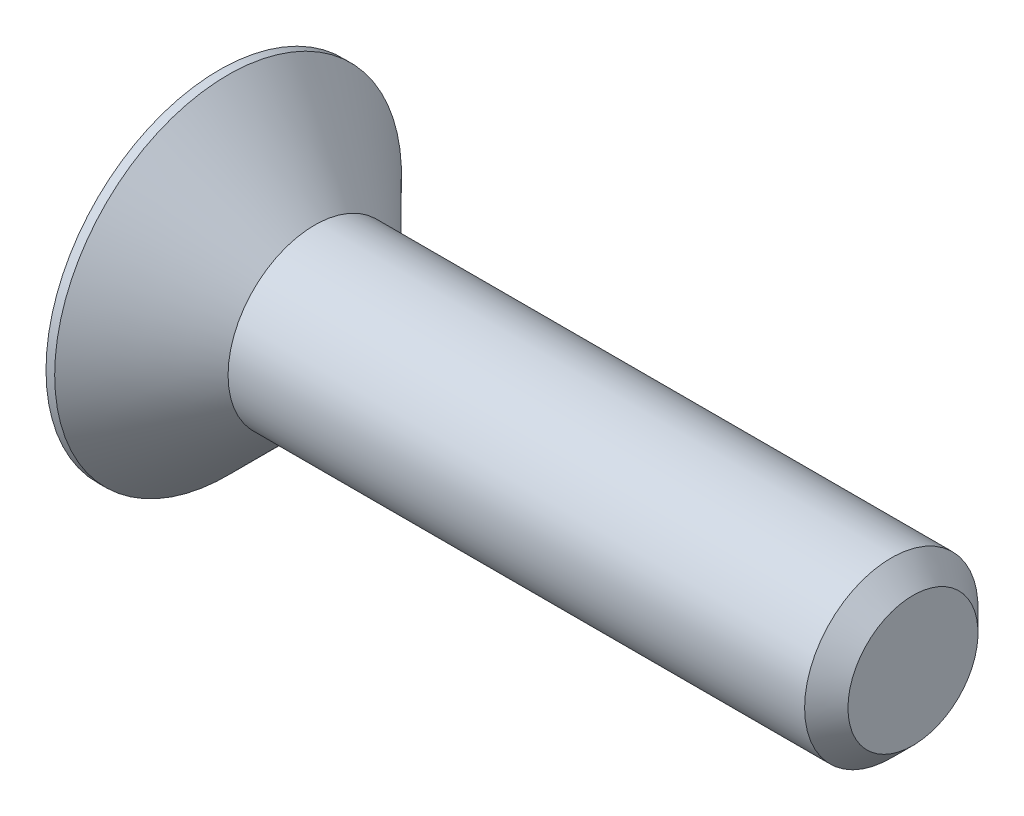
ISO-10303-21;
HEADER;
FILE_DESCRIPTION(('STEP AP214'),'2;1');
FILE_NAME('part.step','',(''),(''),'','','');
FILE_SCHEMA(('AUTOMOTIVE_DESIGN { 1 0 10303 214 1 1 1 1 }'));
ENDSEC;
DATA;
#1=APPLICATION_CONTEXT('core data for automotive mechanical design processes');
#2=APPLICATION_PROTOCOL_DEFINITION('international standard','automotive_design',2000,#1);
#3=PRODUCT_CONTEXT('',#1,'mechanical');
#4=PRODUCT('Part','Part','',(#3));
#5=PRODUCT_RELATED_PRODUCT_CATEGORY('part','',(#4));
#6=PRODUCT_DEFINITION_FORMATION('','',#4);
#7=PRODUCT_DEFINITION_CONTEXT('part definition',#1,'design');
#8=PRODUCT_DEFINITION('design','',#6,#7);
#9=PRODUCT_DEFINITION_SHAPE('','',#8);
#10=(LENGTH_UNIT() NAMED_UNIT(*) SI_UNIT(.MILLI.,.METRE.));
#11=(NAMED_UNIT(*) PLANE_ANGLE_UNIT() SI_UNIT($,.RADIAN.));
#12=(NAMED_UNIT(*) SI_UNIT($,.STERADIAN.) SOLID_ANGLE_UNIT());
#13=UNCERTAINTY_MEASURE_WITH_UNIT(LENGTH_MEASURE(1.E-05),#10,'distance_accuracy_value','');
#14=(GEOMETRIC_REPRESENTATION_CONTEXT(3) GLOBAL_UNCERTAINTY_ASSIGNED_CONTEXT((#13)) GLOBAL_UNIT_ASSIGNED_CONTEXT((#10,
#11,#12)) REPRESENTATION_CONTEXT('',''));
#15=CARTESIAN_POINT('',(0.,0.,0.));
#16=DIRECTION('',(0.,0.,1.));
#17=DIRECTION('',(1.,0.,0.));
#18=AXIS2_PLACEMENT_3D('',#15,#16,#17);
#19=CARTESIAN_POINT('',(0.,0.,0.));
#20=DIRECTION('',(1.,0.,0.));
#21=DIRECTION('',(0.,0.,-1.));
#22=AXIS2_PLACEMENT_3D('',#19,#20,#21);
#23=PLANE('',#22);
#24=DIRECTION('',(0.,0.866025403784439,0.5));
#25=VECTOR('',#24,1.);
#26=CARTESIAN_POINT('',(0.,-0.75,0.433012701892219));
#27=LINE('',#26,#25);
#28=CARTESIAN_POINT('',(0.,-0.75,0.433012701892219));
#29=VERTEX_POINT('',#28);
#30=CARTESIAN_POINT('',(0.,0.,0.866025403784438));
#31=VERTEX_POINT('',#30);
#32=EDGE_CURVE('E122',#29,#31,#27,.T.);
#33=ORIENTED_EDGE('',*,*,#32,.F.);
#34=DIRECTION('',(0.,0.,1.));
#35=VECTOR('',#34,1.);
#36=CARTESIAN_POINT('',(0.,-0.75,-0.43301270189222));
#37=LINE('',#36,#35);
#38=CARTESIAN_POINT('',(0.,-0.75,-0.43301270189222));
#39=VERTEX_POINT('',#38);
#40=EDGE_CURVE('E48',#39,#29,#37,.T.);
#41=ORIENTED_EDGE('',*,*,#40,.F.);
#42=DIRECTION('',(0.,-0.866025403784439,0.5));
#43=VECTOR('',#42,1.);
#44=CARTESIAN_POINT('',(0.,0.,-0.866025403784439));
#45=LINE('',#44,#43);
#46=CARTESIAN_POINT('',(0.,0.,-0.866025403784439));
#47=VERTEX_POINT('',#46);
#48=EDGE_CURVE('E131',#47,#39,#45,.T.);
#49=ORIENTED_EDGE('',*,*,#48,.F.);
#50=DIRECTION('',(0.,-0.866025403784439,-0.5));
#51=VECTOR('',#50,1.);
#52=CARTESIAN_POINT('',(0.,0.75,-0.43301270189222));
#53=LINE('',#52,#51);
#54=CARTESIAN_POINT('',(0.,0.75,-0.43301270189222));
#55=VERTEX_POINT('',#54);
#56=EDGE_CURVE('E129',#55,#47,#53,.T.);
#57=ORIENTED_EDGE('',*,*,#56,.F.);
#58=DIRECTION('',(0.,0.,-1.));
#59=VECTOR('',#58,1.);
#60=CARTESIAN_POINT('',(0.,0.75,0.433012701892219));
#61=LINE('',#60,#59);
#62=CARTESIAN_POINT('',(0.,0.75,0.433012701892219));
#63=VERTEX_POINT('',#62);
#64=EDGE_CURVE('E96',#63,#55,#61,.T.);
#65=ORIENTED_EDGE('',*,*,#64,.F.);
#66=DIRECTION('',(0.,0.866025403784439,-0.5));
#67=VECTOR('',#66,1.);
#68=CARTESIAN_POINT('',(0.,0.,0.866025403784438));
#69=LINE('',#68,#67);
#70=EDGE_CURVE('E125',#31,#63,#69,.T.);
#71=ORIENTED_EDGE('',*,*,#70,.F.);
#72=EDGE_LOOP('',(#33,#41,#49,#57,#65,#71));
#73=FACE_BOUND('',#72,.T.);
#74=CARTESIAN_POINT('',(0.,0.,0.));
#75=DIRECTION('',(-1.,0.,0.));
#76=DIRECTION('',(0.,0.,1.));
#77=AXIS2_PLACEMENT_3D('',#74,#75,#76);
#78=CIRCLE('',#77,2.);
#79=CARTESIAN_POINT('',(0.,0.,2.));
#80=VERTEX_POINT('',#79);
#81=EDGE_CURVE('E11',#80,#80,#78,.T.);
#82=ORIENTED_EDGE('',*,*,#81,.T.);
#83=EDGE_LOOP('',(#82));
#84=FACE_BOUND('',#83,.T.);
#85=ADVANCED_FACE('F34',(#73,#84),#23,.F.);
#86=CARTESIAN_POINT('',(-2.28184155946539,0.,0.));
#87=DIRECTION('',(-1.,0.,0.));
#88=DIRECTION('',(0.,0.,1.));
#89=AXIS2_PLACEMENT_3D('',#86,#87,#88);
#90=CYLINDRICAL_SURFACE('',#89,2.);
#91=ORIENTED_EDGE('',*,*,#81,.F.);
#92=EDGE_LOOP('',(#91));
#93=FACE_BOUND('',#92,.T.);
#94=CARTESIAN_POINT('',(0.0999999999999998,0.,0.));
#95=DIRECTION('',(-1.,0.,0.));
#96=DIRECTION('',(0.,0.,1.));
#97=AXIS2_PLACEMENT_3D('',#94,#95,#96);
#98=CIRCLE('',#97,2.);
#99=CARTESIAN_POINT('',(0.0999999999999998,0.,2.));
#100=VERTEX_POINT('',#99);
#101=EDGE_CURVE('E41',#100,#100,#98,.T.);
#102=ORIENTED_EDGE('',*,*,#101,.T.);
#103=EDGE_LOOP('',(#102));
#104=FACE_BOUND('',#103,.T.);
#105=ADVANCED_FACE('F151',(#93,#104),#90,.T.);
#106=CARTESIAN_POINT('',(1.1,0.,0.));
#107=DIRECTION('',(-1.,0.,0.));
#108=DIRECTION('',(0.,0.,1.));
#109=AXIS2_PLACEMENT_3D('',#106,#107,#108);
#110=CONICAL_SURFACE('',#109,1.,0.78539816339745);
#111=ORIENTED_EDGE('',*,*,#101,.F.);
#112=EDGE_LOOP('',(#111));
#113=FACE_BOUND('',#112,.T.);
#114=CARTESIAN_POINT('',(1.1,0.,0.));
#115=DIRECTION('',(-1.,0.,0.));
#116=DIRECTION('',(0.,0.,1.));
#117=AXIS2_PLACEMENT_3D('',#114,#115,#116);
#118=CIRCLE('',#117,1.);
#119=CARTESIAN_POINT('',(1.1,0.,1.));
#120=VERTEX_POINT('',#119);
#121=EDGE_CURVE('E146',#120,#120,#118,.T.);
#122=ORIENTED_EDGE('',*,*,#121,.T.);
#123=EDGE_LOOP('',(#122));
#124=FACE_BOUND('',#123,.T.);
#125=ADVANCED_FACE('F153',(#113,#124),#110,.T.);
#126=CARTESIAN_POINT('',(-2.28184155946539,0.,0.));
#127=DIRECTION('',(-1.,0.,0.));
#128=DIRECTION('',(0.,0.,1.));
#129=AXIS2_PLACEMENT_3D('',#126,#127,#128);
#130=CYLINDRICAL_SURFACE('',#129,1.);
#131=ORIENTED_EDGE('',*,*,#121,.F.);
#132=EDGE_LOOP('',(#131));
#133=FACE_BOUND('',#132,.T.);
#134=CARTESIAN_POINT('',(7.75,0.,0.));
#135=DIRECTION('',(-1.,0.,0.));
#136=DIRECTION('',(0.,0.,1.));
#137=AXIS2_PLACEMENT_3D('',#134,#135,#136);
#138=CIRCLE('',#137,1.);
#139=CARTESIAN_POINT('',(7.75,0.,1.));
#140=VERTEX_POINT('',#139);
#141=EDGE_CURVE('E143',#140,#140,#138,.T.);
#142=ORIENTED_EDGE('',*,*,#141,.T.);
#143=EDGE_LOOP('',(#142));
#144=FACE_BOUND('',#143,.T.);
#145=ADVANCED_FACE('F156',(#133,#144),#130,.T.);
#146=CARTESIAN_POINT('',(8.,0.,0.));
#147=DIRECTION('',(-1.,0.,0.));
#148=DIRECTION('',(0.,0.,1.));
#149=AXIS2_PLACEMENT_3D('',#146,#147,#148);
#150=CONICAL_SURFACE('',#149,0.75,0.785398163397451);
#151=ORIENTED_EDGE('',*,*,#141,.F.);
#152=EDGE_LOOP('',(#151));
#153=FACE_BOUND('',#152,.T.);
#154=CARTESIAN_POINT('',(8.,0.,0.));
#155=DIRECTION('',(-1.,0.,0.));
#156=DIRECTION('',(0.,0.,1.));
#157=AXIS2_PLACEMENT_3D('',#154,#155,#156);
#158=CIRCLE('',#157,0.75);
#159=CARTESIAN_POINT('',(8.,0.,0.75));
#160=VERTEX_POINT('',#159);
#161=EDGE_CURVE('E135',#160,#160,#158,.T.);
#162=ORIENTED_EDGE('',*,*,#161,.T.);
#163=EDGE_LOOP('',(#162));
#164=FACE_BOUND('',#163,.T.);
#165=ADVANCED_FACE('F162',(#153,#164),#150,.T.);
#166=CARTESIAN_POINT('',(8.,0.75,0.));
#167=DIRECTION('',(-1.,0.,0.));
#168=DIRECTION('',(0.,0.,1.));
#169=AXIS2_PLACEMENT_3D('',#166,#167,#168);
#170=PLANE('',#169);
#171=ORIENTED_EDGE('',*,*,#161,.F.);
#172=EDGE_LOOP('',(#171));
#173=FACE_BOUND('',#172,.T.);
#174=ADVANCED_FACE('F168',(#173),#170,.F.);
#175=CARTESIAN_POINT('',(0.8,-0.75,-0.43301270189222));
#176=DIRECTION('',(0.,-1.,0.));
#177=DIRECTION('',(0.,0.,-1.));
#178=AXIS2_PLACEMENT_3D('',#175,#176,#177);
#179=PLANE('',#178);
#180=ORIENTED_EDGE('',*,*,#40,.T.);
#181=DIRECTION('',(-1.,0.,0.));
#182=VECTOR('',#181,1.);
#183=CARTESIAN_POINT('',(0.8,-0.75,0.433012701892219));
#184=LINE('',#183,#182);
#185=CARTESIAN_POINT('',(0.8,-0.75,0.433012701892219));
#186=VERTEX_POINT('',#185);
#187=EDGE_CURVE('E78',#186,#29,#184,.T.);
#188=ORIENTED_EDGE('',*,*,#187,.F.);
#189=DIRECTION('',(0.,0.,1.));
#190=VECTOR('',#189,1.);
#191=CARTESIAN_POINT('',(0.8,-0.75,-0.43301270189222));
#192=LINE('',#191,#190);
#193=CARTESIAN_POINT('',(0.8,-0.75,-0.43301270189222));
#194=VERTEX_POINT('',#193);
#195=EDGE_CURVE('E133',#194,#186,#192,.T.);
#196=ORIENTED_EDGE('',*,*,#195,.F.);
#197=DIRECTION('',(-1.,0.,0.));
#198=VECTOR('',#197,1.);
#199=CARTESIAN_POINT('',(0.8,-0.75,-0.43301270189222));
#200=LINE('',#199,#198);
#201=EDGE_CURVE('E56',#194,#39,#200,.T.);
#202=ORIENTED_EDGE('',*,*,#201,.T.);
#203=EDGE_LOOP('',(#180,#188,#196,#202));
#204=FACE_BOUND('',#203,.T.);
#205=ADVANCED_FACE('F173',(#204),#179,.F.);
#206=CARTESIAN_POINT('',(0.8,0.,-0.866025403784439));
#207=DIRECTION('',(0.,-0.5,-0.866025403784439));
#208=DIRECTION('',(0.,0.866025403784439,-0.5));
#209=AXIS2_PLACEMENT_3D('',#206,#207,#208);
#210=PLANE('',#209);
#211=ORIENTED_EDGE('',*,*,#48,.T.);
#212=ORIENTED_EDGE('',*,*,#201,.F.);
#213=DIRECTION('',(0.,-0.866025403784439,0.5));
#214=VECTOR('',#213,1.);
#215=CARTESIAN_POINT('',(0.8,0.,-0.866025403784439));
#216=LINE('',#215,#214);
#217=CARTESIAN_POINT('',(0.8,0.,-0.866025403784439));
#218=VERTEX_POINT('',#217);
#219=EDGE_CURVE('E108',#218,#194,#216,.T.);
#220=ORIENTED_EDGE('',*,*,#219,.F.);
#221=DIRECTION('',(-1.,0.,0.));
#222=VECTOR('',#221,1.);
#223=CARTESIAN_POINT('',(0.8,0.,-0.866025403784439));
#224=LINE('',#223,#222);
#225=EDGE_CURVE('E100',#218,#47,#224,.T.);
#226=ORIENTED_EDGE('',*,*,#225,.T.);
#227=EDGE_LOOP('',(#211,#212,#220,#226));
#228=FACE_BOUND('',#227,.T.);
#229=ADVANCED_FACE('F178',(#228),#210,.F.);
#230=CARTESIAN_POINT('',(0.8,0.75,-0.43301270189222));
#231=DIRECTION('',(0.,0.5,-0.866025403784439));
#232=DIRECTION('',(0.,0.866025403784439,0.5));
#233=AXIS2_PLACEMENT_3D('',#230,#231,#232);
#234=PLANE('',#233);
#235=ORIENTED_EDGE('',*,*,#56,.T.);
#236=ORIENTED_EDGE('',*,*,#225,.F.);
#237=DIRECTION('',(0.,-0.866025403784439,-0.5));
#238=VECTOR('',#237,1.);
#239=CARTESIAN_POINT('',(0.8,0.75,-0.43301270189222));
#240=LINE('',#239,#238);
#241=CARTESIAN_POINT('',(0.8,0.75,-0.43301270189222));
#242=VERTEX_POINT('',#241);
#243=EDGE_CURVE('E104',#242,#218,#240,.T.);
#244=ORIENTED_EDGE('',*,*,#243,.F.);
#245=DIRECTION('',(-1.,0.,0.));
#246=VECTOR('',#245,1.);
#247=CARTESIAN_POINT('',(0.8,0.75,-0.43301270189222));
#248=LINE('',#247,#246);
#249=EDGE_CURVE('E89',#242,#55,#248,.T.);
#250=ORIENTED_EDGE('',*,*,#249,.T.);
#251=EDGE_LOOP('',(#235,#236,#244,#250));
#252=FACE_BOUND('',#251,.T.);
#253=ADVANCED_FACE('F105',(#252),#234,.F.);
#254=CARTESIAN_POINT('',(0.8,0.75,0.433012701892219));
#255=DIRECTION('',(0.,1.,0.));
#256=DIRECTION('',(0.,0.,1.));
#257=AXIS2_PLACEMENT_3D('',#254,#255,#256);
#258=PLANE('',#257);
#259=ORIENTED_EDGE('',*,*,#64,.T.);
#260=ORIENTED_EDGE('',*,*,#249,.F.);
#261=DIRECTION('',(0.,0.,-1.));
#262=VECTOR('',#261,1.);
#263=CARTESIAN_POINT('',(0.8,0.75,0.433012701892219));
#264=LINE('',#263,#262);
#265=CARTESIAN_POINT('',(0.8,0.75,0.433012701892219));
#266=VERTEX_POINT('',#265);
#267=EDGE_CURVE('E93',#266,#242,#264,.T.);
#268=ORIENTED_EDGE('',*,*,#267,.F.);
#269=DIRECTION('',(-1.,0.,0.));
#270=VECTOR('',#269,1.);
#271=CARTESIAN_POINT('',(0.8,0.75,0.433012701892219));
#272=LINE('',#271,#270);
#273=EDGE_CURVE('E101',#266,#63,#272,.T.);
#274=ORIENTED_EDGE('',*,*,#273,.T.);
#275=EDGE_LOOP('',(#259,#260,#268,#274));
#276=FACE_BOUND('',#275,.T.);
#277=ADVANCED_FACE('F91',(#276),#258,.F.);
#278=CARTESIAN_POINT('',(0.8,0.,0.866025403784438));
#279=DIRECTION('',(0.,0.5,0.866025403784439));
#280=DIRECTION('',(0.,-0.866025403784439,0.5));
#281=AXIS2_PLACEMENT_3D('',#278,#279,#280);
#282=PLANE('',#281);
#283=ORIENTED_EDGE('',*,*,#70,.T.);
#284=ORIENTED_EDGE('',*,*,#273,.F.);
#285=DIRECTION('',(0.,0.866025403784439,-0.5));
#286=VECTOR('',#285,1.);
#287=CARTESIAN_POINT('',(0.8,0.,0.866025403784438));
#288=LINE('',#287,#286);
#289=CARTESIAN_POINT('',(0.8,0.,0.866025403784438));
#290=VERTEX_POINT('',#289);
#291=EDGE_CURVE('E114',#290,#266,#288,.T.);
#292=ORIENTED_EDGE('',*,*,#291,.F.);
#293=DIRECTION('',(-1.,0.,0.));
#294=VECTOR('',#293,1.);
#295=CARTESIAN_POINT('',(0.8,0.,0.866025403784438));
#296=LINE('',#295,#294);
#297=EDGE_CURVE('E138',#290,#31,#296,.T.);
#298=ORIENTED_EDGE('',*,*,#297,.T.);
#299=EDGE_LOOP('',(#283,#284,#292,#298));
#300=FACE_BOUND('',#299,.T.);
#301=ADVANCED_FACE('F204',(#300),#282,.F.);
#302=CARTESIAN_POINT('',(0.8,-0.75,0.433012701892219));
#303=DIRECTION('',(0.,-0.5,0.866025403784439));
#304=DIRECTION('',(0.,-0.866025403784439,-0.5));
#305=AXIS2_PLACEMENT_3D('',#302,#303,#304);
#306=PLANE('',#305);
#307=ORIENTED_EDGE('',*,*,#32,.T.);
#308=ORIENTED_EDGE('',*,*,#297,.F.);
#309=DIRECTION('',(0.,0.866025403784439,0.5));
#310=VECTOR('',#309,1.);
#311=CARTESIAN_POINT('',(0.8,-0.75,0.433012701892219));
#312=LINE('',#311,#310);
#313=EDGE_CURVE('E116',#186,#290,#312,.T.);
#314=ORIENTED_EDGE('',*,*,#313,.F.);
#315=ORIENTED_EDGE('',*,*,#187,.T.);
#316=EDGE_LOOP('',(#307,#308,#314,#315));
#317=FACE_BOUND('',#316,.T.);
#318=ADVANCED_FACE('F192',(#317),#306,.F.);
#319=CARTESIAN_POINT('',(0.8,0.,0.));
#320=DIRECTION('',(-1.,0.,0.));
#321=DIRECTION('',(0.,0.,1.));
#322=AXIS2_PLACEMENT_3D('',#319,#320,#321);
#323=PLANE('',#322);
#324=ORIENTED_EDGE('',*,*,#195,.T.);
#325=ORIENTED_EDGE('',*,*,#313,.T.);
#326=ORIENTED_EDGE('',*,*,#291,.T.);
#327=ORIENTED_EDGE('',*,*,#267,.T.);
#328=ORIENTED_EDGE('',*,*,#243,.T.);
#329=ORIENTED_EDGE('',*,*,#219,.T.);
#330=EDGE_LOOP('',(#324,#325,#326,#327,#328,#329));
#331=FACE_BOUND('',#330,.T.);
#332=ADVANCED_FACE('F111',(#331),#323,.T.);
#333=CLOSED_SHELL('',(#85,#105,#125,#145,#165,#174,#205,#229,#253,#277,#301,#318,#332));
#334=MANIFOLD_SOLID_BREP('B2',#333);
#335=ADVANCED_BREP_SHAPE_REPRESENTATION('',(#18,#334),#14);
#336=SHAPE_DEFINITION_REPRESENTATION(#9,#335);
ENDSEC;
END-ISO-10303-21;
